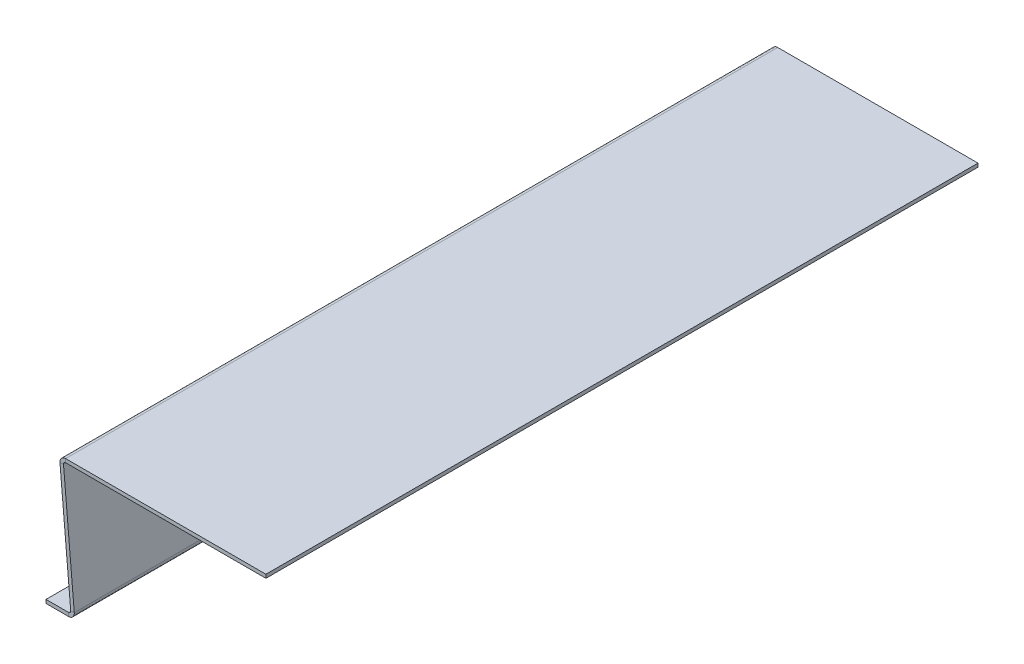
ISO-10303-21;
HEADER;
FILE_DESCRIPTION(('STEP AP214'),'2;1');
FILE_NAME('part.step','',(''),(''),'','','');
FILE_SCHEMA(('AUTOMOTIVE_DESIGN { 1 0 10303 214 1 1 1 1 }'));
ENDSEC;
DATA;
#1=APPLICATION_CONTEXT('core data for automotive mechanical design processes');
#2=APPLICATION_PROTOCOL_DEFINITION('international standard','automotive_design',2000,#1);
#3=PRODUCT_CONTEXT('',#1,'mechanical');
#4=PRODUCT('Part','Part','',(#3));
#5=PRODUCT_RELATED_PRODUCT_CATEGORY('part','',(#4));
#6=PRODUCT_DEFINITION_FORMATION('','',#4);
#7=PRODUCT_DEFINITION_CONTEXT('part definition',#1,'design');
#8=PRODUCT_DEFINITION('design','',#6,#7);
#9=PRODUCT_DEFINITION_SHAPE('','',#8);
#10=(LENGTH_UNIT() NAMED_UNIT(*) SI_UNIT(.MILLI.,.METRE.));
#11=(NAMED_UNIT(*) PLANE_ANGLE_UNIT() SI_UNIT($,.RADIAN.));
#12=(NAMED_UNIT(*) SI_UNIT($,.STERADIAN.) SOLID_ANGLE_UNIT());
#13=UNCERTAINTY_MEASURE_WITH_UNIT(LENGTH_MEASURE(1.E-05),#10,'distance_accuracy_value','');
#14=(GEOMETRIC_REPRESENTATION_CONTEXT(3) GLOBAL_UNCERTAINTY_ASSIGNED_CONTEXT((#13)) GLOBAL_UNIT_ASSIGNED_CONTEXT((#10,
#11,#12)) REPRESENTATION_CONTEXT('',''));
#15=CARTESIAN_POINT('',(0.,0.,0.));
#16=DIRECTION('',(0.,0.,1.));
#17=DIRECTION('',(1.,0.,0.));
#18=AXIS2_PLACEMENT_3D('',#15,#16,#17);
#19=CARTESIAN_POINT('',(-289.23908957618,-8.69724594198118,-1000.));
#20=DIRECTION('',(0.,0.,-1.));
#21=DIRECTION('',(-1.,0.,0.));
#22=AXIS2_PLACEMENT_3D('',#19,#20,#21);
#23=PLANE('',#22);
#24=DIRECTION('',(0.996194698091745,0.0871557427476611,0.));
#25=VECTOR('',#24,1.);
#26=CARTESIAN_POINT('',(-289.23908957618,-8.69724594198118,-1000.));
#27=LINE('',#26,#25);
#28=CARTESIAN_POINT('',(-289.23908957618,-8.69724594198118,-1000.));
#29=VERTEX_POINT('',#28);
#30=CARTESIAN_POINT('',(-284.258116085721,-8.26146722824284,-1000.));
#31=VERTEX_POINT('',#30);
#32=EDGE_CURVE('E13',#29,#31,#27,.T.);
#33=ORIENTED_EDGE('',*,*,#32,.F.);
#34=CARTESIAN_POINT('',(-281.269531991446,-8.00000000000001,-1000.));
#35=DIRECTION('',(0.,0.,-1.));
#36=DIRECTION('',(-1.,0.,0.));
#37=AXIS2_PLACEMENT_3D('',#34,#35,#36);
#38=CIRCLE('',#37,8.);
#39=CARTESIAN_POINT('',(-281.269531991446,0.,-1000.));
#40=VERTEX_POINT('',#39);
#41=EDGE_CURVE('E145',#40,#29,#38,.F.);
#42=ORIENTED_EDGE('',*,*,#41,.F.);
#43=DIRECTION('',(0.,1.,0.));
#44=VECTOR('',#43,1.);
#45=CARTESIAN_POINT('',(-281.269531991446,-4.99999999999989,-1000.));
#46=LINE('',#45,#44);
#47=CARTESIAN_POINT('',(-281.269531991446,-4.99999999999989,-1000.));
#48=VERTEX_POINT('',#47);
#49=EDGE_CURVE('E52',#48,#40,#46,.T.);
#50=ORIENTED_EDGE('',*,*,#49,.F.);
#51=CARTESIAN_POINT('',(-281.269531991446,-8.00000000000001,-1000.));
#52=DIRECTION('',(0.,0.,1.));
#53=DIRECTION('',(1.,0.,0.));
#54=AXIS2_PLACEMENT_3D('',#51,#52,#53);
#55=CIRCLE('',#54,3.);
#56=EDGE_CURVE('E148',#48,#31,#55,.T.);
#57=ORIENTED_EDGE('',*,*,#56,.T.);
#58=EDGE_LOOP('',(#33,#42,#50,#57));
#59=FACE_BOUND('',#58,.T.);
#60=ADVANCED_FACE('F44',(#59),#23,.T.);
#61=CARTESIAN_POINT('',(-281.269531991446,-4.99999999999989,-1000.));
#62=DIRECTION('',(0.,0.,-1.));
#63=DIRECTION('',(-1.,0.,0.));
#64=AXIS2_PLACEMENT_3D('',#61,#62,#63);
#65=PLANE('',#64);
#66=DIRECTION('',(0.0871557427476618,-0.996194698091745,0.));
#67=VECTOR('',#66,1.);
#68=CARTESIAN_POINT('',(-290.,0.,-1000.));
#69=LINE('',#68,#67);
#70=CARTESIAN_POINT('',(-274.099938656636,-181.738532771757,-1000.));
#71=VERTEX_POINT('',#70);
#72=EDGE_CURVE('E159',#29,#71,#69,.T.);
#73=ORIENTED_EDGE('',*,*,#72,.F.);
#74=ORIENTED_EDGE('',*,*,#32,.T.);
#75=DIRECTION('',(0.0871557427476618,-0.996194698091745,0.));
#76=VECTOR('',#75,1.);
#77=CARTESIAN_POINT('',(-285.019026509541,0.435778713738344,-1000.));
#78=LINE('',#77,#76);
#79=CARTESIAN_POINT('',(-269.118965166177,-181.302754058019,-1000.));
#80=VERTEX_POINT('',#79);
#81=EDGE_CURVE('E264',#31,#80,#78,.T.);
#82=ORIENTED_EDGE('',*,*,#81,.T.);
#83=DIRECTION('',(-0.996194698091743,-0.0871557427476852,0.));
#84=VECTOR('',#83,1.);
#85=CARTESIAN_POINT('',(-269.118965166177,-181.302754058019,-1000.));
#86=LINE('',#85,#84);
#87=EDGE_CURVE('E169',#80,#71,#86,.T.);
#88=ORIENTED_EDGE('',*,*,#87,.T.);
#89=EDGE_LOOP('',(#73,#74,#82,#88));
#90=FACE_BOUND('',#89,.T.);
#91=ADVANCED_FACE('F168',(#90),#65,.T.);
#92=CARTESIAN_POINT('',(-281.269531991446,0.,0.));
#93=DIRECTION('',(0.,0.,1.));
#94=DIRECTION('',(1.,0.,0.));
#95=AXIS2_PLACEMENT_3D('',#92,#93,#94);
#96=PLANE('',#95);
#97=DIRECTION('',(0.,-1.,0.));
#98=VECTOR('',#97,1.);
#99=CARTESIAN_POINT('',(-281.269531991446,0.,0.));
#100=LINE('',#99,#98);
#101=CARTESIAN_POINT('',(-281.269531991446,0.,0.));
#102=VERTEX_POINT('',#101);
#103=CARTESIAN_POINT('',(-281.269531991446,-4.99999999999989,0.));
#104=VERTEX_POINT('',#103);
#105=EDGE_CURVE('E246',#102,#104,#100,.T.);
#106=ORIENTED_EDGE('',*,*,#105,.F.);
#107=CARTESIAN_POINT('',(-281.269531991446,-8.00000000000001,0.));
#108=DIRECTION('',(0.,0.,-1.));
#109=DIRECTION('',(-1.,0.,0.));
#110=AXIS2_PLACEMENT_3D('',#107,#108,#109);
#111=CIRCLE('',#110,8.);
#112=CARTESIAN_POINT('',(-289.23908957618,-8.69724594198118,0.));
#113=VERTEX_POINT('',#112);
#114=EDGE_CURVE('E209',#102,#113,#111,.F.);
#115=ORIENTED_EDGE('',*,*,#114,.T.);
#116=DIRECTION('',(-0.996194698091745,-0.0871557427476611,0.));
#117=VECTOR('',#116,1.);
#118=CARTESIAN_POINT('',(-284.258116085721,-8.26146722824284,0.));
#119=LINE('',#118,#117);
#120=CARTESIAN_POINT('',(-284.258116085721,-8.26146722824284,0.));
#121=VERTEX_POINT('',#120);
#122=EDGE_CURVE('E244',#121,#113,#119,.T.);
#123=ORIENTED_EDGE('',*,*,#122,.F.);
#124=CARTESIAN_POINT('',(-281.269531991446,-8.00000000000001,0.));
#125=DIRECTION('',(0.,0.,1.));
#126=DIRECTION('',(1.,0.,0.));
#127=AXIS2_PLACEMENT_3D('',#124,#125,#126);
#128=CIRCLE('',#127,3.);
#129=EDGE_CURVE('E198',#104,#121,#128,.T.);
#130=ORIENTED_EDGE('',*,*,#129,.F.);
#131=EDGE_LOOP('',(#106,#115,#123,#130));
#132=FACE_BOUND('',#131,.T.);
#133=ADVANCED_FACE('F313',(#132),#96,.T.);
#134=CARTESIAN_POINT('',(-284.258116085721,-8.26146722824284,0.));
#135=DIRECTION('',(0.,0.,1.));
#136=DIRECTION('',(1.,0.,0.));
#137=AXIS2_PLACEMENT_3D('',#134,#135,#136);
#138=PLANE('',#137);
#139=DIRECTION('',(-1.,0.,0.));
#140=VECTOR('',#139,1.);
#141=CARTESIAN_POINT('',(0.,0.,0.));
#142=LINE('',#141,#140);
#143=CARTESIAN_POINT('',(0.,0.,0.));
#144=VERTEX_POINT('',#143);
#145=EDGE_CURVE('E206',#144,#102,#142,.T.);
#146=ORIENTED_EDGE('',*,*,#145,.T.);
#147=ORIENTED_EDGE('',*,*,#105,.T.);
#148=DIRECTION('',(1.,0.,0.));
#149=VECTOR('',#148,1.);
#150=CARTESIAN_POINT('',(0.,-4.99999999999989,0.));
#151=LINE('',#150,#149);
#152=CARTESIAN_POINT('',(0.,-4.99999999999989,0.));
#153=VERTEX_POINT('',#152);
#154=EDGE_CURVE('E201',#153,#104,#151,.F.);
#155=ORIENTED_EDGE('',*,*,#154,.F.);
#156=DIRECTION('',(0.,-1.,0.));
#157=VECTOR('',#156,1.);
#158=CARTESIAN_POINT('',(0.,0.,0.));
#159=LINE('',#158,#157);
#160=EDGE_CURVE('E204',#144,#153,#159,.T.);
#161=ORIENTED_EDGE('',*,*,#160,.F.);
#162=EDGE_LOOP('',(#146,#147,#155,#161));
#163=FACE_BOUND('',#162,.T.);
#164=ADVANCED_FACE('F317',(#163),#138,.T.);
#165=CARTESIAN_POINT('',(-277.088522750911,-185.,-1000.));
#166=DIRECTION('',(0.,0.,-1.));
#167=DIRECTION('',(-1.,0.,0.));
#168=AXIS2_PLACEMENT_3D('',#165,#166,#167);
#169=PLANE('',#168);
#170=DIRECTION('',(0.,-1.,0.));
#171=VECTOR('',#170,1.);
#172=CARTESIAN_POINT('',(-277.088522750911,-185.,-1000.));
#173=LINE('',#172,#171);
#174=CARTESIAN_POINT('',(-277.088522750911,-185.,-1000.));
#175=VERTEX_POINT('',#174);
#176=CARTESIAN_POINT('',(-277.088522750911,-190.,-1000.));
#177=VERTEX_POINT('',#176);
#178=EDGE_CURVE('E60',#175,#177,#173,.T.);
#179=ORIENTED_EDGE('',*,*,#178,.F.);
#180=CARTESIAN_POINT('',(-277.088522750911,-182.,-1000.));
#181=DIRECTION('',(0.,0.,1.));
#182=DIRECTION('',(1.,0.,0.));
#183=AXIS2_PLACEMENT_3D('',#180,#181,#182);
#184=CIRCLE('',#183,3.);
#185=EDGE_CURVE('E171',#71,#175,#184,.F.);
#186=ORIENTED_EDGE('',*,*,#185,.F.);
#187=ORIENTED_EDGE('',*,*,#87,.F.);
#188=CARTESIAN_POINT('',(-277.088522750911,-182.,-1000.));
#189=DIRECTION('',(0.,0.,1.));
#190=DIRECTION('',(1.,0.,0.));
#191=AXIS2_PLACEMENT_3D('',#188,#189,#190);
#192=CIRCLE('',#191,8.);
#193=EDGE_CURVE('E266',#80,#177,#192,.F.);
#194=ORIENTED_EDGE('',*,*,#193,.T.);
#195=EDGE_LOOP('',(#179,#186,#187,#194));
#196=FACE_BOUND('',#195,.T.);
#197=ADVANCED_FACE('F281',(#196),#169,.T.);
#198=CARTESIAN_POINT('',(-269.118965166177,-181.302754058019,-1000.));
#199=DIRECTION('',(0.,0.,-1.));
#200=DIRECTION('',(-1.,0.,0.));
#201=AXIS2_PLACEMENT_3D('',#198,#199,#200);
#202=PLANE('',#201);
#203=DIRECTION('',(-1.,0.,0.));
#204=VECTOR('',#203,1.);
#205=CARTESIAN_POINT('',(-273.814597247703,-185.,-1000.));
#206=LINE('',#205,#204);
#207=CARTESIAN_POINT('',(-308.814597247703,-185.,-1000.));
#208=VERTEX_POINT('',#207);
#209=EDGE_CURVE('E214',#175,#208,#206,.T.);
#210=ORIENTED_EDGE('',*,*,#209,.F.);
#211=ORIENTED_EDGE('',*,*,#178,.T.);
#212=DIRECTION('',(-1.,0.,0.));
#213=VECTOR('',#212,1.);
#214=CARTESIAN_POINT('',(-273.814597247703,-190.,-1000.));
#215=LINE('',#214,#213);
#216=CARTESIAN_POINT('',(-308.814597247703,-190.,-1000.));
#217=VERTEX_POINT('',#216);
#218=EDGE_CURVE('E270',#177,#217,#215,.T.);
#219=ORIENTED_EDGE('',*,*,#218,.T.);
#220=DIRECTION('',(0.,1.,0.));
#221=VECTOR('',#220,1.);
#222=CARTESIAN_POINT('',(-308.814597247703,-190.,-1000.));
#223=LINE('',#222,#221);
#224=EDGE_CURVE('E117',#217,#208,#223,.T.);
#225=ORIENTED_EDGE('',*,*,#224,.T.);
#226=EDGE_LOOP('',(#210,#211,#219,#225));
#227=FACE_BOUND('',#226,.T.);
#228=ADVANCED_FACE('F277',(#227),#202,.T.);
#229=CARTESIAN_POINT('',(-274.099938656636,-181.738532771757,0.));
#230=DIRECTION('',(0.,0.,1.));
#231=DIRECTION('',(1.,0.,0.));
#232=AXIS2_PLACEMENT_3D('',#229,#230,#231);
#233=PLANE('',#232);
#234=DIRECTION('',(0.996194698091743,0.0871557427476852,0.));
#235=VECTOR('',#234,1.);
#236=CARTESIAN_POINT('',(-274.099938656636,-181.738532771757,0.));
#237=LINE('',#236,#235);
#238=CARTESIAN_POINT('',(-274.099938656636,-181.738532771757,0.));
#239=VERTEX_POINT('',#238);
#240=CARTESIAN_POINT('',(-269.118965166177,-181.302754058019,0.));
#241=VERTEX_POINT('',#240);
#242=EDGE_CURVE('E101',#239,#241,#237,.T.);
#243=ORIENTED_EDGE('',*,*,#242,.F.);
#244=CARTESIAN_POINT('',(-277.088522750911,-182.,0.));
#245=DIRECTION('',(0.,0.,1.));
#246=DIRECTION('',(1.,0.,0.));
#247=AXIS2_PLACEMENT_3D('',#244,#245,#246);
#248=CIRCLE('',#247,3.);
#249=CARTESIAN_POINT('',(-277.088522750911,-185.,0.));
#250=VERTEX_POINT('',#249);
#251=EDGE_CURVE('E212',#239,#250,#248,.F.);
#252=ORIENTED_EDGE('',*,*,#251,.T.);
#253=DIRECTION('',(0.,1.,0.));
#254=VECTOR('',#253,1.);
#255=CARTESIAN_POINT('',(-277.088522750911,-190.,0.));
#256=LINE('',#255,#254);
#257=CARTESIAN_POINT('',(-277.088522750911,-190.,0.));
#258=VERTEX_POINT('',#257);
#259=EDGE_CURVE('E108',#258,#250,#256,.T.);
#260=ORIENTED_EDGE('',*,*,#259,.F.);
#261=CARTESIAN_POINT('',(-277.088522750911,-182.,0.));
#262=DIRECTION('',(0.,0.,1.));
#263=DIRECTION('',(1.,0.,0.));
#264=AXIS2_PLACEMENT_3D('',#261,#262,#263);
#265=CIRCLE('',#264,8.);
#266=EDGE_CURVE('E192',#241,#258,#265,.F.);
#267=ORIENTED_EDGE('',*,*,#266,.F.);
#268=EDGE_LOOP('',(#243,#252,#260,#267));
#269=FACE_BOUND('',#268,.T.);
#270=ADVANCED_FACE('F298',(#269),#233,.T.);
#271=CARTESIAN_POINT('',(-277.088522750911,-190.,0.));
#272=DIRECTION('',(0.,0.,1.));
#273=DIRECTION('',(1.,0.,0.));
#274=AXIS2_PLACEMENT_3D('',#271,#272,#273);
#275=PLANE('',#274);
#276=DIRECTION('',(0.0871557427476618,-0.996194698091745,0.));
#277=VECTOR('',#276,1.);
#278=CARTESIAN_POINT('',(-290.,0.,0.));
#279=LINE('',#278,#277);
#280=EDGE_CURVE('E161',#113,#239,#279,.T.);
#281=ORIENTED_EDGE('',*,*,#280,.T.);
#282=ORIENTED_EDGE('',*,*,#242,.T.);
#283=DIRECTION('',(0.0871557427476618,-0.996194698091745,0.));
#284=VECTOR('',#283,1.);
#285=CARTESIAN_POINT('',(-285.019026509541,0.435778713738344,0.));
#286=LINE('',#285,#284);
#287=EDGE_CURVE('E195',#121,#241,#286,.T.);
#288=ORIENTED_EDGE('',*,*,#287,.F.);
#289=ORIENTED_EDGE('',*,*,#122,.T.);
#290=EDGE_LOOP('',(#281,#282,#288,#289));
#291=FACE_BOUND('',#290,.T.);
#292=ADVANCED_FACE('F300',(#291),#275,.T.);
#293=CARTESIAN_POINT('',(-273.814597247703,-185.,-1000.));
#294=DIRECTION('',(0.,1.,0.));
#295=DIRECTION('',(-1.,0.,0.));
#296=AXIS2_PLACEMENT_3D('',#293,#294,#295);
#297=PLANE('',#296);
#298=DIRECTION('',(-1.,0.,0.));
#299=VECTOR('',#298,1.);
#300=CARTESIAN_POINT('',(-273.814597247703,-185.,0.));
#301=LINE('',#300,#299);
#302=CARTESIAN_POINT('',(-308.814597247703,-185.,0.));
#303=VERTEX_POINT('',#302);
#304=EDGE_CURVE('E185',#250,#303,#301,.T.);
#305=ORIENTED_EDGE('',*,*,#304,.F.);
#306=DIRECTION('',(0.,0.,1.));
#307=VECTOR('',#306,1.);
#308=CARTESIAN_POINT('',(-277.088522750911,-185.,-1000.));
#309=LINE('',#308,#307);
#310=EDGE_CURVE('E215',#175,#250,#309,.T.);
#311=ORIENTED_EDGE('',*,*,#310,.F.);
#312=ORIENTED_EDGE('',*,*,#209,.T.);
#313=DIRECTION('',(0.,0.,1.));
#314=VECTOR('',#313,1.);
#315=CARTESIAN_POINT('',(-308.814597247703,-185.,-1000.));
#316=LINE('',#315,#314);
#317=EDGE_CURVE('E184',#208,#303,#316,.T.);
#318=ORIENTED_EDGE('',*,*,#317,.T.);
#319=EDGE_LOOP('',(#305,#311,#312,#318));
#320=FACE_BOUND('',#319,.T.);
#321=ADVANCED_FACE('F276',(#320),#297,.T.);
#322=CARTESIAN_POINT('',(-277.088522750911,-182.,-1000.));
#323=DIRECTION('',(0.,0.,1.));
#324=DIRECTION('',(1.,0.,0.));
#325=AXIS2_PLACEMENT_3D('',#322,#323,#324);
#326=CYLINDRICAL_SURFACE('',#325,3.);
#327=ORIENTED_EDGE('',*,*,#251,.F.);
#328=DIRECTION('',(0.,0.,1.));
#329=VECTOR('',#328,1.);
#330=CARTESIAN_POINT('',(-274.099938656636,-181.738532771757,-1000.));
#331=LINE('',#330,#329);
#332=EDGE_CURVE('E165',#71,#239,#331,.T.);
#333=ORIENTED_EDGE('',*,*,#332,.F.);
#334=ORIENTED_EDGE('',*,*,#185,.T.);
#335=ORIENTED_EDGE('',*,*,#310,.T.);
#336=EDGE_LOOP('',(#327,#333,#334,#335));
#337=FACE_BOUND('',#336,.T.);
#338=ADVANCED_FACE('F280',(#337),#326,.F.);
#339=CARTESIAN_POINT('',(-290.,0.,-1000.));
#340=DIRECTION('',(-0.996194698091745,-0.0871557427476618,0.));
#341=DIRECTION('',(0.0871557427476618,-0.996194698091745,0.));
#342=AXIS2_PLACEMENT_3D('',#339,#340,#341);
#343=PLANE('',#342);
#344=ORIENTED_EDGE('',*,*,#280,.F.);
#345=DIRECTION('',(0.,0.,1.));
#346=VECTOR('',#345,1.);
#347=CARTESIAN_POINT('',(-289.23908957618,-8.69724594198118,-1000.));
#348=LINE('',#347,#346);
#349=EDGE_CURVE('E157',#29,#113,#348,.T.);
#350=ORIENTED_EDGE('',*,*,#349,.F.);
#351=ORIENTED_EDGE('',*,*,#72,.T.);
#352=ORIENTED_EDGE('',*,*,#332,.T.);
#353=EDGE_LOOP('',(#344,#350,#351,#352));
#354=FACE_BOUND('',#353,.T.);
#355=ADVANCED_FACE('F158',(#354),#343,.T.);
#356=CARTESIAN_POINT('',(-281.269531991446,-8.00000000000001,-1000.));
#357=DIRECTION('',(0.,0.,1.));
#358=DIRECTION('',(1.,0.,0.));
#359=AXIS2_PLACEMENT_3D('',#356,#357,#358);
#360=CYLINDRICAL_SURFACE('',#359,8.);
#361=ORIENTED_EDGE('',*,*,#114,.F.);
#362=DIRECTION('',(0.,0.,1.));
#363=VECTOR('',#362,1.);
#364=CARTESIAN_POINT('',(-281.269531991446,0.,-1000.));
#365=LINE('',#364,#363);
#366=EDGE_CURVE('E166',#40,#102,#365,.T.);
#367=ORIENTED_EDGE('',*,*,#366,.F.);
#368=ORIENTED_EDGE('',*,*,#41,.T.);
#369=ORIENTED_EDGE('',*,*,#349,.T.);
#370=EDGE_LOOP('',(#361,#367,#368,#369));
#371=FACE_BOUND('',#370,.T.);
#372=ADVANCED_FACE('F174',(#371),#360,.T.);
#373=CARTESIAN_POINT('',(0.,0.,-1000.));
#374=DIRECTION('',(0.,1.,0.));
#375=DIRECTION('',(0.,0.,1.));
#376=AXIS2_PLACEMENT_3D('',#373,#374,#375);
#377=PLANE('',#376);
#378=ORIENTED_EDGE('',*,*,#145,.F.);
#379=DIRECTION('',(0.,0.,1.));
#380=VECTOR('',#379,1.);
#381=CARTESIAN_POINT('',(0.,0.,-1000.));
#382=LINE('',#381,#380);
#383=CARTESIAN_POINT('',(0.,0.,-1000.));
#384=VERTEX_POINT('',#383);
#385=EDGE_CURVE('E219',#384,#144,#382,.T.);
#386=ORIENTED_EDGE('',*,*,#385,.F.);
#387=DIRECTION('',(-1.,0.,0.));
#388=VECTOR('',#387,1.);
#389=CARTESIAN_POINT('',(0.,0.,-1000.));
#390=LINE('',#389,#388);
#391=EDGE_CURVE('E176',#384,#40,#390,.T.);
#392=ORIENTED_EDGE('',*,*,#391,.T.);
#393=ORIENTED_EDGE('',*,*,#366,.T.);
#394=EDGE_LOOP('',(#378,#386,#392,#393));
#395=FACE_BOUND('',#394,.T.);
#396=ADVANCED_FACE('F382',(#395),#377,.T.);
#397=CARTESIAN_POINT('',(0.,0.,-1000.));
#398=DIRECTION('',(-1.,0.,0.));
#399=DIRECTION('',(0.,0.,1.));
#400=AXIS2_PLACEMENT_3D('',#397,#398,#399);
#401=PLANE('',#400);
#402=ORIENTED_EDGE('',*,*,#160,.T.);
#403=DIRECTION('',(0.,0.,1.));
#404=VECTOR('',#403,1.);
#405=CARTESIAN_POINT('',(0.,-4.99999999999989,-1000.));
#406=LINE('',#405,#404);
#407=CARTESIAN_POINT('',(0.,-4.99999999999989,-1000.));
#408=VERTEX_POINT('',#407);
#409=EDGE_CURVE('E221',#408,#153,#406,.T.);
#410=ORIENTED_EDGE('',*,*,#409,.F.);
#411=DIRECTION('',(0.,-1.,0.));
#412=VECTOR('',#411,1.);
#413=CARTESIAN_POINT('',(0.,0.,-1000.));
#414=LINE('',#413,#412);
#415=EDGE_CURVE('E178',#384,#408,#414,.T.);
#416=ORIENTED_EDGE('',*,*,#415,.F.);
#417=ORIENTED_EDGE('',*,*,#385,.T.);
#418=EDGE_LOOP('',(#402,#410,#416,#417));
#419=FACE_BOUND('',#418,.T.);
#420=ADVANCED_FACE('F391',(#419),#401,.F.);
#421=CARTESIAN_POINT('',(0.,-4.99999999999989,-1000.));
#422=DIRECTION('',(0.,1.,0.));
#423=DIRECTION('',(0.,0.,1.));
#424=AXIS2_PLACEMENT_3D('',#421,#422,#423);
#425=PLANE('',#424);
#426=ORIENTED_EDGE('',*,*,#154,.T.);
#427=DIRECTION('',(0.,0.,1.));
#428=VECTOR('',#427,1.);
#429=CARTESIAN_POINT('',(-281.269531991446,-4.99999999999989,-1000.));
#430=LINE('',#429,#428);
#431=EDGE_CURVE('E224',#48,#104,#430,.T.);
#432=ORIENTED_EDGE('',*,*,#431,.F.);
#433=DIRECTION('',(1.,0.,0.));
#434=VECTOR('',#433,1.);
#435=CARTESIAN_POINT('',(0.,-4.99999999999989,-1000.));
#436=LINE('',#435,#434);
#437=EDGE_CURVE('E252',#408,#48,#436,.F.);
#438=ORIENTED_EDGE('',*,*,#437,.F.);
#439=ORIENTED_EDGE('',*,*,#409,.T.);
#440=EDGE_LOOP('',(#426,#432,#438,#439));
#441=FACE_BOUND('',#440,.T.);
#442=ADVANCED_FACE('F258',(#441),#425,.F.);
#443=CARTESIAN_POINT('',(-281.269531991446,-8.00000000000001,-1000.));
#444=DIRECTION('',(0.,0.,1.));
#445=DIRECTION('',(1.,0.,0.));
#446=AXIS2_PLACEMENT_3D('',#443,#444,#445);
#447=CYLINDRICAL_SURFACE('',#446,3.);
#448=ORIENTED_EDGE('',*,*,#129,.T.);
#449=DIRECTION('',(0.,0.,1.));
#450=VECTOR('',#449,1.);
#451=CARTESIAN_POINT('',(-284.258116085721,-8.26146722824284,-1000.));
#452=LINE('',#451,#450);
#453=EDGE_CURVE('E227',#31,#121,#452,.T.);
#454=ORIENTED_EDGE('',*,*,#453,.F.);
#455=ORIENTED_EDGE('',*,*,#56,.F.);
#456=ORIENTED_EDGE('',*,*,#431,.T.);
#457=EDGE_LOOP('',(#448,#454,#455,#456));
#458=FACE_BOUND('',#457,.T.);
#459=ADVANCED_FACE('F262',(#458),#447,.F.);
#460=CARTESIAN_POINT('',(-285.019026509541,0.435778713738344,-1000.));
#461=DIRECTION('',(-0.996194698091745,-0.0871557427476618,0.));
#462=DIRECTION('',(0.0871557427476618,-0.996194698091745,0.));
#463=AXIS2_PLACEMENT_3D('',#460,#461,#462);
#464=PLANE('',#463);
#465=ORIENTED_EDGE('',*,*,#287,.T.);
#466=DIRECTION('',(0.,0.,1.));
#467=VECTOR('',#466,1.);
#468=CARTESIAN_POINT('',(-269.118965166177,-181.302754058019,-1000.));
#469=LINE('',#468,#467);
#470=EDGE_CURVE('E230',#80,#241,#469,.T.);
#471=ORIENTED_EDGE('',*,*,#470,.F.);
#472=ORIENTED_EDGE('',*,*,#81,.F.);
#473=ORIENTED_EDGE('',*,*,#453,.T.);
#474=EDGE_LOOP('',(#465,#471,#472,#473));
#475=FACE_BOUND('',#474,.T.);
#476=ADVANCED_FACE('F286',(#475),#464,.F.);
#477=CARTESIAN_POINT('',(-277.088522750911,-182.,-1000.));
#478=DIRECTION('',(0.,0.,1.));
#479=DIRECTION('',(1.,0.,0.));
#480=AXIS2_PLACEMENT_3D('',#477,#478,#479);
#481=CYLINDRICAL_SURFACE('',#480,8.);
#482=ORIENTED_EDGE('',*,*,#266,.T.);
#483=DIRECTION('',(0.,0.,1.));
#484=VECTOR('',#483,1.);
#485=CARTESIAN_POINT('',(-277.088522750911,-190.,-1000.));
#486=LINE('',#485,#484);
#487=EDGE_CURVE('E233',#177,#258,#486,.T.);
#488=ORIENTED_EDGE('',*,*,#487,.F.);
#489=ORIENTED_EDGE('',*,*,#193,.F.);
#490=ORIENTED_EDGE('',*,*,#470,.T.);
#491=EDGE_LOOP('',(#482,#488,#489,#490));
#492=FACE_BOUND('',#491,.T.);
#493=ADVANCED_FACE('F289',(#492),#481,.T.);
#494=CARTESIAN_POINT('',(-273.814597247703,-190.,-1000.));
#495=DIRECTION('',(0.,1.,0.));
#496=DIRECTION('',(-1.,0.,0.));
#497=AXIS2_PLACEMENT_3D('',#494,#495,#496);
#498=PLANE('',#497);
#499=DIRECTION('',(-1.,0.,0.));
#500=VECTOR('',#499,1.);
#501=CARTESIAN_POINT('',(-273.814597247703,-190.,0.));
#502=LINE('',#501,#500);
#503=CARTESIAN_POINT('',(-308.814597247703,-190.,0.));
#504=VERTEX_POINT('',#503);
#505=EDGE_CURVE('E190',#258,#504,#502,.T.);
#506=ORIENTED_EDGE('',*,*,#505,.T.);
#507=DIRECTION('',(0.,0.,1.));
#508=VECTOR('',#507,1.);
#509=CARTESIAN_POINT('',(-308.814597247703,-190.,-1000.));
#510=LINE('',#509,#508);
#511=EDGE_CURVE('E236',#217,#504,#510,.T.);
#512=ORIENTED_EDGE('',*,*,#511,.F.);
#513=ORIENTED_EDGE('',*,*,#218,.F.);
#514=ORIENTED_EDGE('',*,*,#487,.T.);
#515=EDGE_LOOP('',(#506,#512,#513,#514));
#516=FACE_BOUND('',#515,.T.);
#517=ADVANCED_FACE('F293',(#516),#498,.F.);
#518=CARTESIAN_POINT('',(-308.814597247703,-190.,-1000.));
#519=DIRECTION('',(1.,0.,0.));
#520=DIRECTION('',(0.,0.,-1.));
#521=AXIS2_PLACEMENT_3D('',#518,#519,#520);
#522=PLANE('',#521);
#523=DIRECTION('',(0.,1.,0.));
#524=VECTOR('',#523,1.);
#525=CARTESIAN_POINT('',(-308.814597247703,-190.,0.));
#526=LINE('',#525,#524);
#527=EDGE_CURVE('E187',#504,#303,#526,.T.);
#528=ORIENTED_EDGE('',*,*,#527,.T.);
#529=ORIENTED_EDGE('',*,*,#317,.F.);
#530=ORIENTED_EDGE('',*,*,#224,.F.);
#531=ORIENTED_EDGE('',*,*,#511,.T.);
#532=EDGE_LOOP('',(#528,#529,#530,#531));
#533=FACE_BOUND('',#532,.T.);
#534=ADVANCED_FACE('F296',(#533),#522,.F.);
#535=CARTESIAN_POINT('',(-277.088522750911,-182.,-1000.));
#536=DIRECTION('',(0.,0.,1.));
#537=DIRECTION('',(1.,0.,0.));
#538=AXIS2_PLACEMENT_3D('',#535,#536,#537);
#539=PLANE('',#538);
#540=ORIENTED_EDGE('',*,*,#437,.T.);
#541=ORIENTED_EDGE('',*,*,#49,.T.);
#542=ORIENTED_EDGE('',*,*,#391,.F.);
#543=ORIENTED_EDGE('',*,*,#415,.T.);
#544=EDGE_LOOP('',(#540,#541,#542,#543));
#545=FACE_BOUND('',#544,.T.);
#546=ADVANCED_FACE('F250',(#545),#539,.F.);
#547=CARTESIAN_POINT('',(-277.088522750911,-182.,0.));
#548=DIRECTION('',(0.,0.,1.));
#549=DIRECTION('',(1.,0.,0.));
#550=AXIS2_PLACEMENT_3D('',#547,#548,#549);
#551=PLANE('',#550);
#552=ORIENTED_EDGE('',*,*,#304,.T.);
#553=ORIENTED_EDGE('',*,*,#527,.F.);
#554=ORIENTED_EDGE('',*,*,#505,.F.);
#555=ORIENTED_EDGE('',*,*,#259,.T.);
#556=EDGE_LOOP('',(#552,#553,#554,#555));
#557=FACE_BOUND('',#556,.T.);
#558=ADVANCED_FACE('F297',(#557),#551,.T.);
#559=CLOSED_SHELL('',(#60,#91,#133,#164,#197,#228,#270,#292,#321,#338,#355,#372,#396,#420,#442,
#459,#476,#493,#517,#534,#546,#558));
#560=MANIFOLD_SOLID_BREP('B2',#559);
#561=ADVANCED_BREP_SHAPE_REPRESENTATION('',(#18,#560),#14);
#562=SHAPE_DEFINITION_REPRESENTATION(#9,#561);
ENDSEC;
END-ISO-10303-21;
